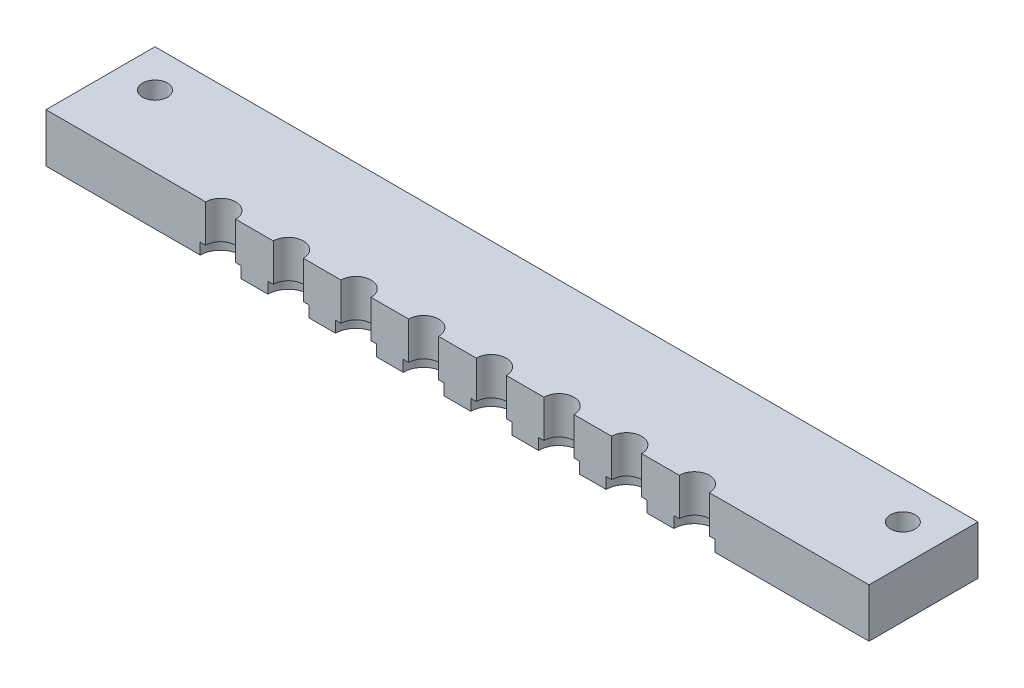
ISO-10303-21;
HEADER;
FILE_DESCRIPTION(('STEP AP214'),'2;1');
FILE_NAME('part.step','',(''),(''),'','','');
FILE_SCHEMA(('AUTOMOTIVE_DESIGN { 1 0 10303 214 1 1 1 1 }'));
ENDSEC;
DATA;
#1=APPLICATION_CONTEXT('core data for automotive mechanical design processes');
#2=APPLICATION_PROTOCOL_DEFINITION('international standard','automotive_design',2000,#1);
#3=PRODUCT_CONTEXT('',#1,'mechanical');
#4=PRODUCT('Part','Part','',(#3));
#5=PRODUCT_RELATED_PRODUCT_CATEGORY('part','',(#4));
#6=PRODUCT_DEFINITION_FORMATION('','',#4);
#7=PRODUCT_DEFINITION_CONTEXT('part definition',#1,'design');
#8=PRODUCT_DEFINITION('design','',#6,#7);
#9=PRODUCT_DEFINITION_SHAPE('','',#8);
#10=(LENGTH_UNIT() NAMED_UNIT(*) SI_UNIT(.MILLI.,.METRE.));
#11=(NAMED_UNIT(*) PLANE_ANGLE_UNIT() SI_UNIT($,.RADIAN.));
#12=(NAMED_UNIT(*) SI_UNIT($,.STERADIAN.) SOLID_ANGLE_UNIT());
#13=UNCERTAINTY_MEASURE_WITH_UNIT(LENGTH_MEASURE(1.E-05),#10,'distance_accuracy_value','');
#14=(GEOMETRIC_REPRESENTATION_CONTEXT(3) GLOBAL_UNCERTAINTY_ASSIGNED_CONTEXT((#13)) GLOBAL_UNIT_ASSIGNED_CONTEXT((#10,
#11,#12)) REPRESENTATION_CONTEXT('',''));
#15=CARTESIAN_POINT('',(0.,0.,0.));
#16=DIRECTION('',(0.,0.,1.));
#17=DIRECTION('',(1.,0.,0.));
#18=AXIS2_PLACEMENT_3D('',#15,#16,#17);
#19=CARTESIAN_POINT('',(0.,0.,0.));
#20=DIRECTION('',(0.,0.,1.));
#21=DIRECTION('',(1.,0.,0.));
#22=AXIS2_PLACEMENT_3D('',#19,#20,#21);
#23=PLANE('',#22);
#24=DIRECTION('',(-1.,0.,0.));
#25=VECTOR('',#24,1.);
#26=CARTESIAN_POINT('',(0.,-22.175,0.));
#27=LINE('',#26,#25);
#28=CARTESIAN_POINT('',(-34.225,-22.175,0.));
#29=VERTEX_POINT('',#28);
#30=CARTESIAN_POINT('',(-54.74,-22.175,0.));
#31=VERTEX_POINT('',#30);
#32=EDGE_CURVE('E391',#29,#31,#27,.T.);
#33=ORIENTED_EDGE('',*,*,#32,.F.);
#34=DIRECTION('',(0.,1.,0.));
#35=VECTOR('',#34,1.);
#36=CARTESIAN_POINT('',(-34.225,22.175,0.));
#37=LINE('',#36,#35);
#38=CARTESIAN_POINT('',(-34.225,-20.675,0.));
#39=VERTEX_POINT('',#38);
#40=EDGE_CURVE('E290',#29,#39,#37,.T.);
#41=ORIENTED_EDGE('',*,*,#40,.T.);
#42=DIRECTION('',(1.,0.,0.));
#43=VECTOR('',#42,1.);
#44=CARTESIAN_POINT('',(-34.225,-20.675,0.));
#45=LINE('',#44,#43);
#46=CARTESIAN_POINT('',(-33.5,-20.675,0.));
#47=VERTEX_POINT('',#46);
#48=EDGE_CURVE('E273',#39,#47,#45,.T.);
#49=ORIENTED_EDGE('',*,*,#48,.T.);
#50=DIRECTION('',(0.,1.,0.));
#51=VECTOR('',#50,1.);
#52=CARTESIAN_POINT('',(-33.5,22.175,0.));
#53=LINE('',#52,#51);
#54=CARTESIAN_POINT('',(-33.5,-15.675,0.));
#55=VERTEX_POINT('',#54);
#56=EDGE_CURVE('E287',#47,#55,#53,.T.);
#57=ORIENTED_EDGE('',*,*,#56,.T.);
#58=DIRECTION('',(1.,0.,0.));
#59=VECTOR('',#58,1.);
#60=CARTESIAN_POINT('',(0.,-15.675,0.));
#61=LINE('',#60,#59);
#62=CARTESIAN_POINT('',(-54.74,-15.675,0.));
#63=VERTEX_POINT('',#62);
#64=EDGE_CURVE('E388',#63,#55,#61,.T.);
#65=ORIENTED_EDGE('',*,*,#64,.F.);
#66=DIRECTION('',(0.,1.,0.));
#67=VECTOR('',#66,1.);
#68=CARTESIAN_POINT('',(-54.74,0.,0.));
#69=LINE('',#68,#67);
#70=EDGE_CURVE('E389',#31,#63,#69,.T.);
#71=ORIENTED_EDGE('',*,*,#70,.F.);
#72=EDGE_LOOP('',(#33,#41,#49,#57,#65,#71));
#73=FACE_BOUND('',#72,.T.);
#74=ADVANCED_FACE('F34',(#73),#23,.T.);
#75=CARTESIAN_POINT('',(-25.225,-22.175,0.));
#76=VERTEX_POINT('',#75);
#77=CARTESIAN_POINT('',(-28.775,-22.175,0.));
#78=VERTEX_POINT('',#77);
#79=EDGE_CURVE('E958',#76,#78,#27,.T.);
#80=ORIENTED_EDGE('',*,*,#79,.F.);
#81=DIRECTION('',(0.,1.,0.));
#82=VECTOR('',#81,1.);
#83=CARTESIAN_POINT('',(-25.225,22.175,0.));
#84=LINE('',#83,#82);
#85=CARTESIAN_POINT('',(-25.225,-20.675,0.));
#86=VERTEX_POINT('',#85);
#87=EDGE_CURVE('E498',#76,#86,#84,.T.);
#88=ORIENTED_EDGE('',*,*,#87,.T.);
#89=DIRECTION('',(1.,0.,0.));
#90=VECTOR('',#89,1.);
#91=CARTESIAN_POINT('',(-25.225,-20.675,0.));
#92=LINE('',#91,#90);
#93=CARTESIAN_POINT('',(-24.5,-20.675,0.));
#94=VERTEX_POINT('',#93);
#95=EDGE_CURVE('E501',#86,#94,#92,.T.);
#96=ORIENTED_EDGE('',*,*,#95,.T.);
#97=DIRECTION('',(0.,1.,0.));
#98=VECTOR('',#97,1.);
#99=CARTESIAN_POINT('',(-24.5,22.175,0.));
#100=LINE('',#99,#98);
#101=CARTESIAN_POINT('',(-24.5,-15.675,0.));
#102=VERTEX_POINT('',#101);
#103=EDGE_CURVE('E508',#94,#102,#100,.T.);
#104=ORIENTED_EDGE('',*,*,#103,.T.);
#105=CARTESIAN_POINT('',(-29.5,-15.675,0.));
#106=VERTEX_POINT('',#105);
#107=EDGE_CURVE('E518',#106,#102,#61,.T.);
#108=ORIENTED_EDGE('',*,*,#107,.F.);
#109=DIRECTION('',(0.,1.,0.));
#110=VECTOR('',#109,1.);
#111=CARTESIAN_POINT('',(-29.5,22.175,0.));
#112=LINE('',#111,#110);
#113=CARTESIAN_POINT('',(-29.5,-20.675,0.));
#114=VERTEX_POINT('',#113);
#115=EDGE_CURVE('E295',#106,#114,#112,.F.);
#116=ORIENTED_EDGE('',*,*,#115,.T.);
#117=CARTESIAN_POINT('',(-28.775,-20.675,0.));
#118=VERTEX_POINT('',#117);
#119=EDGE_CURVE('E275',#114,#118,#45,.T.);
#120=ORIENTED_EDGE('',*,*,#119,.T.);
#121=DIRECTION('',(0.,1.,0.));
#122=VECTOR('',#121,1.);
#123=CARTESIAN_POINT('',(-28.775,22.175,0.));
#124=LINE('',#123,#122);
#125=EDGE_CURVE('E511',#118,#78,#124,.F.);
#126=ORIENTED_EDGE('',*,*,#125,.T.);
#127=EDGE_LOOP('',(#80,#88,#96,#104,#108,#116,#120,#126));
#128=FACE_BOUND('',#127,.T.);
#129=ADVANCED_FACE('F516',(#128),#23,.T.);
#130=CARTESIAN_POINT('',(-16.225,-22.175,0.));
#131=VERTEX_POINT('',#130);
#132=CARTESIAN_POINT('',(-19.775,-22.175,0.));
#133=VERTEX_POINT('',#132);
#134=EDGE_CURVE('E953',#131,#133,#27,.T.);
#135=ORIENTED_EDGE('',*,*,#134,.F.);
#136=DIRECTION('',(0.,1.,0.));
#137=VECTOR('',#136,1.);
#138=CARTESIAN_POINT('',(-16.225,22.175,0.));
#139=LINE('',#138,#137);
#140=CARTESIAN_POINT('',(-16.225,-20.675,0.));
#141=VERTEX_POINT('',#140);
#142=EDGE_CURVE('E482',#131,#141,#139,.T.);
#143=ORIENTED_EDGE('',*,*,#142,.T.);
#144=DIRECTION('',(1.,0.,0.));
#145=VECTOR('',#144,1.);
#146=CARTESIAN_POINT('',(-16.225,-20.675,0.));
#147=LINE('',#146,#145);
#148=CARTESIAN_POINT('',(-15.5,-20.675,0.));
#149=VERTEX_POINT('',#148);
#150=EDGE_CURVE('E485',#141,#149,#147,.T.);
#151=ORIENTED_EDGE('',*,*,#150,.T.);
#152=DIRECTION('',(0.,1.,0.));
#153=VECTOR('',#152,1.);
#154=CARTESIAN_POINT('',(-15.5,22.175,0.));
#155=LINE('',#154,#153);
#156=CARTESIAN_POINT('',(-15.5,-15.675,0.));
#157=VERTEX_POINT('',#156);
#158=EDGE_CURVE('E492',#149,#157,#155,.T.);
#159=ORIENTED_EDGE('',*,*,#158,.T.);
#160=CARTESIAN_POINT('',(-20.5,-15.675,0.));
#161=VERTEX_POINT('',#160);
#162=EDGE_CURVE('E519',#161,#157,#61,.T.);
#163=ORIENTED_EDGE('',*,*,#162,.F.);
#164=DIRECTION('',(0.,1.,0.));
#165=VECTOR('',#164,1.);
#166=CARTESIAN_POINT('',(-20.5,22.175,0.));
#167=LINE('',#166,#165);
#168=CARTESIAN_POINT('',(-20.5,-20.675,0.));
#169=VERTEX_POINT('',#168);
#170=EDGE_CURVE('E505',#161,#169,#167,.F.);
#171=ORIENTED_EDGE('',*,*,#170,.T.);
#172=CARTESIAN_POINT('',(-19.775,-20.675,0.));
#173=VERTEX_POINT('',#172);
#174=EDGE_CURVE('E502',#169,#173,#92,.T.);
#175=ORIENTED_EDGE('',*,*,#174,.T.);
#176=DIRECTION('',(0.,1.,0.));
#177=VECTOR('',#176,1.);
#178=CARTESIAN_POINT('',(-19.775,22.175,0.));
#179=LINE('',#178,#177);
#180=EDGE_CURVE('E495',#173,#133,#179,.F.);
#181=ORIENTED_EDGE('',*,*,#180,.T.);
#182=EDGE_LOOP('',(#135,#143,#151,#159,#163,#171,#175,#181));
#183=FACE_BOUND('',#182,.T.);
#184=ADVANCED_FACE('F926',(#183),#23,.T.);
#185=CARTESIAN_POINT('',(-7.225,-22.175,0.));
#186=VERTEX_POINT('',#185);
#187=CARTESIAN_POINT('',(-10.775,-22.175,0.));
#188=VERTEX_POINT('',#187);
#189=EDGE_CURVE('E959',#186,#188,#27,.T.);
#190=ORIENTED_EDGE('',*,*,#189,.F.);
#191=DIRECTION('',(0.,1.,0.));
#192=VECTOR('',#191,1.);
#193=CARTESIAN_POINT('',(-7.22500000000002,22.175,0.));
#194=LINE('',#193,#192);
#195=CARTESIAN_POINT('',(-7.225,-20.675,0.));
#196=VERTEX_POINT('',#195);
#197=EDGE_CURVE('E466',#186,#196,#194,.T.);
#198=ORIENTED_EDGE('',*,*,#197,.T.);
#199=DIRECTION('',(1.,0.,0.));
#200=VECTOR('',#199,1.);
#201=CARTESIAN_POINT('',(-7.225,-20.675,0.));
#202=LINE('',#201,#200);
#203=CARTESIAN_POINT('',(-6.50000000000001,-20.675,0.));
#204=VERTEX_POINT('',#203);
#205=EDGE_CURVE('E469',#196,#204,#202,.T.);
#206=ORIENTED_EDGE('',*,*,#205,.T.);
#207=DIRECTION('',(0.,1.,0.));
#208=VECTOR('',#207,1.);
#209=CARTESIAN_POINT('',(-6.50000000000002,22.175,0.));
#210=LINE('',#209,#208);
#211=CARTESIAN_POINT('',(-6.5,-15.675,0.));
#212=VERTEX_POINT('',#211);
#213=EDGE_CURVE('E476',#204,#212,#210,.T.);
#214=ORIENTED_EDGE('',*,*,#213,.T.);
#215=CARTESIAN_POINT('',(-11.5,-15.675,0.));
#216=VERTEX_POINT('',#215);
#217=EDGE_CURVE('E520',#216,#212,#61,.T.);
#218=ORIENTED_EDGE('',*,*,#217,.F.);
#219=DIRECTION('',(0.,1.,0.));
#220=VECTOR('',#219,1.);
#221=CARTESIAN_POINT('',(-11.5,22.175,0.));
#222=LINE('',#221,#220);
#223=CARTESIAN_POINT('',(-11.5,-20.675,0.));
#224=VERTEX_POINT('',#223);
#225=EDGE_CURVE('E489',#216,#224,#222,.F.);
#226=ORIENTED_EDGE('',*,*,#225,.T.);
#227=CARTESIAN_POINT('',(-10.775,-20.675,0.));
#228=VERTEX_POINT('',#227);
#229=EDGE_CURVE('E486',#224,#228,#147,.T.);
#230=ORIENTED_EDGE('',*,*,#229,.T.);
#231=DIRECTION('',(0.,1.,0.));
#232=VECTOR('',#231,1.);
#233=CARTESIAN_POINT('',(-10.775,22.175,0.));
#234=LINE('',#233,#232);
#235=EDGE_CURVE('E479',#228,#188,#234,.F.);
#236=ORIENTED_EDGE('',*,*,#235,.T.);
#237=EDGE_LOOP('',(#190,#198,#206,#214,#218,#226,#230,#236));
#238=FACE_BOUND('',#237,.T.);
#239=ADVANCED_FACE('F917',(#238),#23,.T.);
#240=CARTESIAN_POINT('',(1.775,-22.175,0.));
#241=VERTEX_POINT('',#240);
#242=CARTESIAN_POINT('',(-1.77499999999999,-22.175,0.));
#243=VERTEX_POINT('',#242);
#244=EDGE_CURVE('E1000',#241,#243,#27,.T.);
#245=ORIENTED_EDGE('',*,*,#244,.F.);
#246=DIRECTION('',(0.,1.,0.));
#247=VECTOR('',#246,1.);
#248=CARTESIAN_POINT('',(1.77499999999998,22.175,0.));
#249=LINE('',#248,#247);
#250=CARTESIAN_POINT('',(1.775,-20.675,0.));
#251=VERTEX_POINT('',#250);
#252=EDGE_CURVE('E450',#241,#251,#249,.T.);
#253=ORIENTED_EDGE('',*,*,#252,.T.);
#254=DIRECTION('',(1.,0.,0.));
#255=VECTOR('',#254,1.);
#256=CARTESIAN_POINT('',(1.775,-20.675,0.));
#257=LINE('',#256,#255);
#258=CARTESIAN_POINT('',(2.49999999999999,-20.675,0.));
#259=VERTEX_POINT('',#258);
#260=EDGE_CURVE('E453',#251,#259,#257,.T.);
#261=ORIENTED_EDGE('',*,*,#260,.T.);
#262=DIRECTION('',(0.,1.,0.));
#263=VECTOR('',#262,1.);
#264=CARTESIAN_POINT('',(2.49999999999998,22.175,0.));
#265=LINE('',#264,#263);
#266=CARTESIAN_POINT('',(2.5,-15.675,0.));
#267=VERTEX_POINT('',#266);
#268=EDGE_CURVE('E460',#259,#267,#265,.T.);
#269=ORIENTED_EDGE('',*,*,#268,.T.);
#270=CARTESIAN_POINT('',(-2.5,-15.675,0.));
#271=VERTEX_POINT('',#270);
#272=EDGE_CURVE('E521',#271,#267,#61,.T.);
#273=ORIENTED_EDGE('',*,*,#272,.F.);
#274=DIRECTION('',(0.,1.,0.));
#275=VECTOR('',#274,1.);
#276=CARTESIAN_POINT('',(-2.50000000000002,22.175,0.));
#277=LINE('',#276,#275);
#278=CARTESIAN_POINT('',(-2.49999999999998,-20.675,0.));
#279=VERTEX_POINT('',#278);
#280=EDGE_CURVE('E473',#271,#279,#277,.F.);
#281=ORIENTED_EDGE('',*,*,#280,.T.);
#282=CARTESIAN_POINT('',(-1.77499999999999,-20.675,0.));
#283=VERTEX_POINT('',#282);
#284=EDGE_CURVE('E470',#279,#283,#202,.T.);
#285=ORIENTED_EDGE('',*,*,#284,.T.);
#286=DIRECTION('',(0.,1.,0.));
#287=VECTOR('',#286,1.);
#288=CARTESIAN_POINT('',(-1.77500000000001,22.175,0.));
#289=LINE('',#288,#287);
#290=EDGE_CURVE('E463',#283,#243,#289,.F.);
#291=ORIENTED_EDGE('',*,*,#290,.T.);
#292=EDGE_LOOP('',(#245,#253,#261,#269,#273,#281,#285,#291));
#293=FACE_BOUND('',#292,.T.);
#294=ADVANCED_FACE('F908',(#293),#23,.T.);
#295=CARTESIAN_POINT('',(10.775,-22.175,0.));
#296=VERTEX_POINT('',#295);
#297=CARTESIAN_POINT('',(7.22500000000001,-22.175,0.));
#298=VERTEX_POINT('',#297);
#299=EDGE_CURVE('E998',#296,#298,#27,.T.);
#300=ORIENTED_EDGE('',*,*,#299,.F.);
#301=DIRECTION('',(0.,1.,0.));
#302=VECTOR('',#301,1.);
#303=CARTESIAN_POINT('',(10.775,22.175,0.));
#304=LINE('',#303,#302);
#305=CARTESIAN_POINT('',(10.775,-20.675,0.));
#306=VERTEX_POINT('',#305);
#307=EDGE_CURVE('E434',#296,#306,#304,.T.);
#308=ORIENTED_EDGE('',*,*,#307,.T.);
#309=DIRECTION('',(1.,0.,0.));
#310=VECTOR('',#309,1.);
#311=CARTESIAN_POINT('',(10.775,-20.675,0.));
#312=LINE('',#311,#310);
#313=CARTESIAN_POINT('',(11.5,-20.675,0.));
#314=VERTEX_POINT('',#313);
#315=EDGE_CURVE('E437',#306,#314,#312,.T.);
#316=ORIENTED_EDGE('',*,*,#315,.T.);
#317=DIRECTION('',(0.,1.,0.));
#318=VECTOR('',#317,1.);
#319=CARTESIAN_POINT('',(11.5,22.175,0.));
#320=LINE('',#319,#318);
#321=CARTESIAN_POINT('',(11.5,-15.675,0.));
#322=VERTEX_POINT('',#321);
#323=EDGE_CURVE('E444',#314,#322,#320,.T.);
#324=ORIENTED_EDGE('',*,*,#323,.T.);
#325=CARTESIAN_POINT('',(6.5,-15.675,0.));
#326=VERTEX_POINT('',#325);
#327=EDGE_CURVE('E522',#326,#322,#61,.T.);
#328=ORIENTED_EDGE('',*,*,#327,.F.);
#329=DIRECTION('',(0.,1.,0.));
#330=VECTOR('',#329,1.);
#331=CARTESIAN_POINT('',(6.49999999999998,22.175,0.));
#332=LINE('',#331,#330);
#333=CARTESIAN_POINT('',(6.50000000000002,-20.675,0.));
#334=VERTEX_POINT('',#333);
#335=EDGE_CURVE('E457',#326,#334,#332,.F.);
#336=ORIENTED_EDGE('',*,*,#335,.T.);
#337=CARTESIAN_POINT('',(7.22500000000001,-20.675,0.));
#338=VERTEX_POINT('',#337);
#339=EDGE_CURVE('E454',#334,#338,#257,.T.);
#340=ORIENTED_EDGE('',*,*,#339,.T.);
#341=DIRECTION('',(0.,1.,0.));
#342=VECTOR('',#341,1.);
#343=CARTESIAN_POINT('',(7.22499999999999,22.175,0.));
#344=LINE('',#343,#342);
#345=EDGE_CURVE('E447',#338,#298,#344,.F.);
#346=ORIENTED_EDGE('',*,*,#345,.T.);
#347=EDGE_LOOP('',(#300,#308,#316,#324,#328,#336,#340,#346));
#348=FACE_BOUND('',#347,.T.);
#349=ADVANCED_FACE('F899',(#348),#23,.T.);
#350=CARTESIAN_POINT('',(19.775,-22.175,0.));
#351=VERTEX_POINT('',#350);
#352=CARTESIAN_POINT('',(16.225,-22.175,0.));
#353=VERTEX_POINT('',#352);
#354=EDGE_CURVE('E997',#351,#353,#27,.T.);
#355=ORIENTED_EDGE('',*,*,#354,.F.);
#356=DIRECTION('',(0.,1.,0.));
#357=VECTOR('',#356,1.);
#358=CARTESIAN_POINT('',(19.775,22.175,0.));
#359=LINE('',#358,#357);
#360=CARTESIAN_POINT('',(19.775,-20.675,0.));
#361=VERTEX_POINT('',#360);
#362=EDGE_CURVE('E418',#351,#361,#359,.T.);
#363=ORIENTED_EDGE('',*,*,#362,.T.);
#364=DIRECTION('',(1.,0.,0.));
#365=VECTOR('',#364,1.);
#366=CARTESIAN_POINT('',(19.775,-20.675,0.));
#367=LINE('',#366,#365);
#368=CARTESIAN_POINT('',(20.5,-20.675,0.));
#369=VERTEX_POINT('',#368);
#370=EDGE_CURVE('E421',#361,#369,#367,.T.);
#371=ORIENTED_EDGE('',*,*,#370,.T.);
#372=DIRECTION('',(0.,1.,0.));
#373=VECTOR('',#372,1.);
#374=CARTESIAN_POINT('',(20.5,22.175,0.));
#375=LINE('',#374,#373);
#376=CARTESIAN_POINT('',(20.5,-15.675,0.));
#377=VERTEX_POINT('',#376);
#378=EDGE_CURVE('E428',#369,#377,#375,.T.);
#379=ORIENTED_EDGE('',*,*,#378,.T.);
#380=CARTESIAN_POINT('',(15.5,-15.675,0.));
#381=VERTEX_POINT('',#380);
#382=EDGE_CURVE('E523',#381,#377,#61,.T.);
#383=ORIENTED_EDGE('',*,*,#382,.F.);
#384=DIRECTION('',(0.,1.,0.));
#385=VECTOR('',#384,1.);
#386=CARTESIAN_POINT('',(15.5,22.175,0.));
#387=LINE('',#386,#385);
#388=CARTESIAN_POINT('',(15.5,-20.675,0.));
#389=VERTEX_POINT('',#388);
#390=EDGE_CURVE('E441',#381,#389,#387,.F.);
#391=ORIENTED_EDGE('',*,*,#390,.T.);
#392=CARTESIAN_POINT('',(16.225,-20.675,0.));
#393=VERTEX_POINT('',#392);
#394=EDGE_CURVE('E438',#389,#393,#312,.T.);
#395=ORIENTED_EDGE('',*,*,#394,.T.);
#396=DIRECTION('',(0.,1.,0.));
#397=VECTOR('',#396,1.);
#398=CARTESIAN_POINT('',(16.225,22.175,0.));
#399=LINE('',#398,#397);
#400=EDGE_CURVE('E431',#393,#353,#399,.F.);
#401=ORIENTED_EDGE('',*,*,#400,.T.);
#402=EDGE_LOOP('',(#355,#363,#371,#379,#383,#391,#395,#401));
#403=FACE_BOUND('',#402,.T.);
#404=ADVANCED_FACE('F891',(#403),#23,.T.);
#405=CARTESIAN_POINT('',(28.775,-22.175,0.));
#406=VERTEX_POINT('',#405);
#407=CARTESIAN_POINT('',(25.225,-22.175,0.));
#408=VERTEX_POINT('',#407);
#409=EDGE_CURVE('E395',#406,#408,#27,.T.);
#410=ORIENTED_EDGE('',*,*,#409,.F.);
#411=DIRECTION('',(0.,1.,0.));
#412=VECTOR('',#411,1.);
#413=CARTESIAN_POINT('',(28.775,22.175,0.));
#414=LINE('',#413,#412);
#415=CARTESIAN_POINT('',(28.775,-20.675,0.));
#416=VERTEX_POINT('',#415);
#417=EDGE_CURVE('E402',#406,#416,#414,.T.);
#418=ORIENTED_EDGE('',*,*,#417,.T.);
#419=DIRECTION('',(1.,0.,0.));
#420=VECTOR('',#419,1.);
#421=CARTESIAN_POINT('',(28.775,-20.675,0.));
#422=LINE('',#421,#420);
#423=CARTESIAN_POINT('',(29.5,-20.675,0.));
#424=VERTEX_POINT('',#423);
#425=EDGE_CURVE('E405',#416,#424,#422,.T.);
#426=ORIENTED_EDGE('',*,*,#425,.T.);
#427=DIRECTION('',(0.,1.,0.));
#428=VECTOR('',#427,1.);
#429=CARTESIAN_POINT('',(29.5,22.175,0.));
#430=LINE('',#429,#428);
#431=CARTESIAN_POINT('',(29.5,-15.675,0.));
#432=VERTEX_POINT('',#431);
#433=EDGE_CURVE('E412',#424,#432,#430,.T.);
#434=ORIENTED_EDGE('',*,*,#433,.T.);
#435=CARTESIAN_POINT('',(24.5,-15.675,0.));
#436=VERTEX_POINT('',#435);
#437=EDGE_CURVE('E387',#436,#432,#61,.T.);
#438=ORIENTED_EDGE('',*,*,#437,.F.);
#439=DIRECTION('',(0.,1.,0.));
#440=VECTOR('',#439,1.);
#441=CARTESIAN_POINT('',(24.5,22.175,0.));
#442=LINE('',#441,#440);
#443=CARTESIAN_POINT('',(24.5,-20.675,0.));
#444=VERTEX_POINT('',#443);
#445=EDGE_CURVE('E425',#436,#444,#442,.F.);
#446=ORIENTED_EDGE('',*,*,#445,.T.);
#447=CARTESIAN_POINT('',(25.225,-20.675,0.));
#448=VERTEX_POINT('',#447);
#449=EDGE_CURVE('E422',#444,#448,#367,.T.);
#450=ORIENTED_EDGE('',*,*,#449,.T.);
#451=DIRECTION('',(0.,1.,0.));
#452=VECTOR('',#451,1.);
#453=CARTESIAN_POINT('',(25.225,22.175,0.));
#454=LINE('',#453,#452);
#455=EDGE_CURVE('E415',#448,#408,#454,.F.);
#456=ORIENTED_EDGE('',*,*,#455,.T.);
#457=EDGE_LOOP('',(#410,#418,#426,#434,#438,#446,#450,#456));
#458=FACE_BOUND('',#457,.T.);
#459=ADVANCED_FACE('F531',(#458),#23,.T.);
#460=CARTESIAN_POINT('',(54.74,-22.175,0.));
#461=VERTEX_POINT('',#460);
#462=CARTESIAN_POINT('',(34.225,-22.175,0.));
#463=VERTEX_POINT('',#462);
#464=EDGE_CURVE('E392',#461,#463,#27,.T.);
#465=ORIENTED_EDGE('',*,*,#464,.F.);
#466=DIRECTION('',(0.,1.,0.));
#467=VECTOR('',#466,1.);
#468=CARTESIAN_POINT('',(54.74,0.,0.));
#469=LINE('',#468,#467);
#470=CARTESIAN_POINT('',(54.74,-15.675,0.));
#471=VERTEX_POINT('',#470);
#472=EDGE_CURVE('E396',#461,#471,#469,.T.);
#473=ORIENTED_EDGE('',*,*,#472,.T.);
#474=CARTESIAN_POINT('',(33.5,-15.675,0.));
#475=VERTEX_POINT('',#474);
#476=EDGE_CURVE('E302',#475,#471,#61,.T.);
#477=ORIENTED_EDGE('',*,*,#476,.F.);
#478=DIRECTION('',(0.,1.,0.));
#479=VECTOR('',#478,1.);
#480=CARTESIAN_POINT('',(33.5,22.175,0.));
#481=LINE('',#480,#479);
#482=CARTESIAN_POINT('',(33.5,-20.675,0.));
#483=VERTEX_POINT('',#482);
#484=EDGE_CURVE('E409',#475,#483,#481,.F.);
#485=ORIENTED_EDGE('',*,*,#484,.T.);
#486=CARTESIAN_POINT('',(34.225,-20.675,0.));
#487=VERTEX_POINT('',#486);
#488=EDGE_CURVE('E406',#483,#487,#422,.T.);
#489=ORIENTED_EDGE('',*,*,#488,.T.);
#490=DIRECTION('',(0.,1.,0.));
#491=VECTOR('',#490,1.);
#492=CARTESIAN_POINT('',(34.225,22.175,0.));
#493=LINE('',#492,#491);
#494=EDGE_CURVE('E399',#487,#463,#493,.F.);
#495=ORIENTED_EDGE('',*,*,#494,.T.);
#496=EDGE_LOOP('',(#465,#473,#477,#485,#489,#495));
#497=FACE_BOUND('',#496,.T.);
#498=ADVANCED_FACE('F539',(#497),#23,.T.);
#499=CARTESIAN_POINT('',(31.5,22.175,0.));
#500=DIRECTION('',(0.,1.,0.));
#501=DIRECTION('',(-1.,0.,0.));
#502=AXIS2_PLACEMENT_3D('',#499,#500,#501);
#503=CYLINDRICAL_SURFACE('',#502,2.725);
#504=ORIENTED_EDGE('',*,*,#494,.F.);
#505=CARTESIAN_POINT('',(31.5,-20.675,0.));
#506=DIRECTION('',(0.,1.,0.));
#507=DIRECTION('',(-1.,0.,0.));
#508=AXIS2_PLACEMENT_3D('',#505,#506,#507);
#509=CIRCLE('',#508,2.725);
#510=EDGE_CURVE('E346',#487,#416,#509,.T.);
#511=ORIENTED_EDGE('',*,*,#510,.T.);
#512=ORIENTED_EDGE('',*,*,#417,.F.);
#513=CARTESIAN_POINT('',(31.5,-22.175,0.));
#514=DIRECTION('',(0.,1.,0.));
#515=DIRECTION('',(-1.,0.,0.));
#516=AXIS2_PLACEMENT_3D('',#513,#514,#515);
#517=CIRCLE('',#516,2.725);
#518=EDGE_CURVE('E344',#463,#406,#517,.T.);
#519=ORIENTED_EDGE('',*,*,#518,.F.);
#520=EDGE_LOOP('',(#504,#511,#512,#519));
#521=FACE_BOUND('',#520,.T.);
#522=ADVANCED_FACE('F584',(#521),#503,.F.);
#523=CARTESIAN_POINT('',(28.775,-20.675,0.));
#524=DIRECTION('',(0.,1.,0.));
#525=DIRECTION('',(-1.,0.,0.));
#526=AXIS2_PLACEMENT_3D('',#523,#524,#525);
#527=PLANE('',#526);
#528=ORIENTED_EDGE('',*,*,#425,.F.);
#529=ORIENTED_EDGE('',*,*,#510,.F.);
#530=ORIENTED_EDGE('',*,*,#488,.F.);
#531=CARTESIAN_POINT('',(31.5,-20.675,0.));
#532=DIRECTION('',(0.,1.,0.));
#533=DIRECTION('',(-1.,0.,0.));
#534=AXIS2_PLACEMENT_3D('',#531,#532,#533);
#535=CIRCLE('',#534,2.00000000000001);
#536=EDGE_CURVE('E348',#483,#424,#535,.T.);
#537=ORIENTED_EDGE('',*,*,#536,.T.);
#538=EDGE_LOOP('',(#528,#529,#530,#537));
#539=FACE_BOUND('',#538,.T.);
#540=ADVANCED_FACE('F586',(#539),#527,.F.);
#541=CARTESIAN_POINT('',(22.5,22.175,0.));
#542=DIRECTION('',(0.,1.,0.));
#543=DIRECTION('',(-1.,0.,0.));
#544=AXIS2_PLACEMENT_3D('',#541,#542,#543);
#545=CYLINDRICAL_SURFACE('',#544,2.725);
#546=ORIENTED_EDGE('',*,*,#455,.F.);
#547=CARTESIAN_POINT('',(22.5,-20.675,0.));
#548=DIRECTION('',(0.,1.,0.));
#549=DIRECTION('',(-1.,0.,0.));
#550=AXIS2_PLACEMENT_3D('',#547,#548,#549);
#551=CIRCLE('',#550,2.725);
#552=EDGE_CURVE('E340',#448,#361,#551,.T.);
#553=ORIENTED_EDGE('',*,*,#552,.T.);
#554=ORIENTED_EDGE('',*,*,#362,.F.);
#555=CARTESIAN_POINT('',(22.5,-22.175,0.));
#556=DIRECTION('',(0.,1.,0.));
#557=DIRECTION('',(-1.,0.,0.));
#558=AXIS2_PLACEMENT_3D('',#555,#556,#557);
#559=CIRCLE('',#558,2.725);
#560=EDGE_CURVE('E338',#408,#351,#559,.T.);
#561=ORIENTED_EDGE('',*,*,#560,.F.);
#562=EDGE_LOOP('',(#546,#553,#554,#561));
#563=FACE_BOUND('',#562,.T.);
#564=ADVANCED_FACE('F593',(#563),#545,.F.);
#565=CARTESIAN_POINT('',(19.775,-20.675,0.));
#566=DIRECTION('',(0.,1.,0.));
#567=DIRECTION('',(-1.,0.,0.));
#568=AXIS2_PLACEMENT_3D('',#565,#566,#567);
#569=PLANE('',#568);
#570=ORIENTED_EDGE('',*,*,#370,.F.);
#571=ORIENTED_EDGE('',*,*,#552,.F.);
#572=ORIENTED_EDGE('',*,*,#449,.F.);
#573=CARTESIAN_POINT('',(22.5,-20.675,0.));
#574=DIRECTION('',(0.,1.,0.));
#575=DIRECTION('',(-1.,0.,0.));
#576=AXIS2_PLACEMENT_3D('',#573,#574,#575);
#577=CIRCLE('',#576,2.00000000000001);
#578=EDGE_CURVE('E342',#444,#369,#577,.T.);
#579=ORIENTED_EDGE('',*,*,#578,.T.);
#580=EDGE_LOOP('',(#570,#571,#572,#579));
#581=FACE_BOUND('',#580,.T.);
#582=ADVANCED_FACE('F605',(#581),#569,.F.);
#583=CARTESIAN_POINT('',(13.5,22.175,0.));
#584=DIRECTION('',(0.,1.,0.));
#585=DIRECTION('',(-1.,0.,0.));
#586=AXIS2_PLACEMENT_3D('',#583,#584,#585);
#587=CYLINDRICAL_SURFACE('',#586,2.725);
#588=ORIENTED_EDGE('',*,*,#400,.F.);
#589=CARTESIAN_POINT('',(13.5,-20.675,0.));
#590=DIRECTION('',(0.,1.,0.));
#591=DIRECTION('',(-1.,0.,0.));
#592=AXIS2_PLACEMENT_3D('',#589,#590,#591);
#593=CIRCLE('',#592,2.725);
#594=EDGE_CURVE('E334',#393,#306,#593,.T.);
#595=ORIENTED_EDGE('',*,*,#594,.T.);
#596=ORIENTED_EDGE('',*,*,#307,.F.);
#597=CARTESIAN_POINT('',(13.5,-22.175,0.));
#598=DIRECTION('',(0.,1.,0.));
#599=DIRECTION('',(-1.,0.,0.));
#600=AXIS2_PLACEMENT_3D('',#597,#598,#599);
#601=CIRCLE('',#600,2.725);
#602=EDGE_CURVE('E332',#353,#296,#601,.T.);
#603=ORIENTED_EDGE('',*,*,#602,.F.);
#604=EDGE_LOOP('',(#588,#595,#596,#603));
#605=FACE_BOUND('',#604,.T.);
#606=ADVANCED_FACE('F609',(#605),#587,.F.);
#607=CARTESIAN_POINT('',(10.775,-20.675,0.));
#608=DIRECTION('',(0.,1.,0.));
#609=DIRECTION('',(-1.,0.,0.));
#610=AXIS2_PLACEMENT_3D('',#607,#608,#609);
#611=PLANE('',#610);
#612=ORIENTED_EDGE('',*,*,#315,.F.);
#613=ORIENTED_EDGE('',*,*,#594,.F.);
#614=ORIENTED_EDGE('',*,*,#394,.F.);
#615=CARTESIAN_POINT('',(13.5,-20.675,0.));
#616=DIRECTION('',(0.,1.,0.));
#617=DIRECTION('',(-1.,0.,0.));
#618=AXIS2_PLACEMENT_3D('',#615,#616,#617);
#619=CIRCLE('',#618,2.00000000000001);
#620=EDGE_CURVE('E336',#389,#314,#619,.T.);
#621=ORIENTED_EDGE('',*,*,#620,.T.);
#622=EDGE_LOOP('',(#612,#613,#614,#621));
#623=FACE_BOUND('',#622,.T.);
#624=ADVANCED_FACE('F617',(#623),#611,.F.);
#625=CARTESIAN_POINT('',(4.49999999999998,22.175,0.));
#626=DIRECTION('',(0.,1.,0.));
#627=DIRECTION('',(-1.,0.,0.));
#628=AXIS2_PLACEMENT_3D('',#625,#626,#627);
#629=CYLINDRICAL_SURFACE('',#628,2.725);
#630=ORIENTED_EDGE('',*,*,#345,.F.);
#631=CARTESIAN_POINT('',(4.5,-20.675,0.));
#632=DIRECTION('',(0.,1.,0.));
#633=DIRECTION('',(-1.,0.,0.));
#634=AXIS2_PLACEMENT_3D('',#631,#632,#633);
#635=CIRCLE('',#634,2.725);
#636=EDGE_CURVE('E328',#338,#251,#635,.T.);
#637=ORIENTED_EDGE('',*,*,#636,.T.);
#638=ORIENTED_EDGE('',*,*,#252,.F.);
#639=CARTESIAN_POINT('',(4.5,-22.175,0.));
#640=DIRECTION('',(0.,1.,0.));
#641=DIRECTION('',(-1.,0.,0.));
#642=AXIS2_PLACEMENT_3D('',#639,#640,#641);
#643=CIRCLE('',#642,2.725);
#644=EDGE_CURVE('E326',#298,#241,#643,.T.);
#645=ORIENTED_EDGE('',*,*,#644,.F.);
#646=EDGE_LOOP('',(#630,#637,#638,#645));
#647=FACE_BOUND('',#646,.T.);
#648=ADVANCED_FACE('F621',(#647),#629,.F.);
#649=CARTESIAN_POINT('',(1.775,-20.675,0.));
#650=DIRECTION('',(0.,1.,0.));
#651=DIRECTION('',(-1.,0.,0.));
#652=AXIS2_PLACEMENT_3D('',#649,#650,#651);
#653=PLANE('',#652);
#654=ORIENTED_EDGE('',*,*,#260,.F.);
#655=ORIENTED_EDGE('',*,*,#636,.F.);
#656=ORIENTED_EDGE('',*,*,#339,.F.);
#657=CARTESIAN_POINT('',(4.5,-20.675,0.));
#658=DIRECTION('',(0.,1.,0.));
#659=DIRECTION('',(-1.,0.,0.));
#660=AXIS2_PLACEMENT_3D('',#657,#658,#659);
#661=CIRCLE('',#660,2.00000000000001);
#662=EDGE_CURVE('E330',#334,#259,#661,.T.);
#663=ORIENTED_EDGE('',*,*,#662,.T.);
#664=EDGE_LOOP('',(#654,#655,#656,#663));
#665=FACE_BOUND('',#664,.T.);
#666=ADVANCED_FACE('F629',(#665),#653,.F.);
#667=CARTESIAN_POINT('',(-4.50000000000002,22.175,0.));
#668=DIRECTION('',(0.,1.,0.));
#669=DIRECTION('',(-1.,0.,0.));
#670=AXIS2_PLACEMENT_3D('',#667,#668,#669);
#671=CYLINDRICAL_SURFACE('',#670,2.725);
#672=ORIENTED_EDGE('',*,*,#290,.F.);
#673=CARTESIAN_POINT('',(-4.5,-20.675,0.));
#674=DIRECTION('',(0.,1.,0.));
#675=DIRECTION('',(-1.,0.,0.));
#676=AXIS2_PLACEMENT_3D('',#673,#674,#675);
#677=CIRCLE('',#676,2.725);
#678=EDGE_CURVE('E322',#283,#196,#677,.T.);
#679=ORIENTED_EDGE('',*,*,#678,.T.);
#680=ORIENTED_EDGE('',*,*,#197,.F.);
#681=CARTESIAN_POINT('',(-4.5,-22.175,0.));
#682=DIRECTION('',(0.,1.,0.));
#683=DIRECTION('',(-1.,0.,0.));
#684=AXIS2_PLACEMENT_3D('',#681,#682,#683);
#685=CIRCLE('',#684,2.725);
#686=EDGE_CURVE('E320',#243,#186,#685,.T.);
#687=ORIENTED_EDGE('',*,*,#686,.F.);
#688=EDGE_LOOP('',(#672,#679,#680,#687));
#689=FACE_BOUND('',#688,.T.);
#690=ADVANCED_FACE('F633',(#689),#671,.F.);
#691=CARTESIAN_POINT('',(-7.225,-20.675,0.));
#692=DIRECTION('',(0.,1.,0.));
#693=DIRECTION('',(-1.,0.,0.));
#694=AXIS2_PLACEMENT_3D('',#691,#692,#693);
#695=PLANE('',#694);
#696=ORIENTED_EDGE('',*,*,#205,.F.);
#697=ORIENTED_EDGE('',*,*,#678,.F.);
#698=ORIENTED_EDGE('',*,*,#284,.F.);
#699=CARTESIAN_POINT('',(-4.5,-20.675,0.));
#700=DIRECTION('',(0.,1.,0.));
#701=DIRECTION('',(-1.,0.,0.));
#702=AXIS2_PLACEMENT_3D('',#699,#700,#701);
#703=CIRCLE('',#702,2.00000000000001);
#704=EDGE_CURVE('E324',#279,#204,#703,.T.);
#705=ORIENTED_EDGE('',*,*,#704,.T.);
#706=EDGE_LOOP('',(#696,#697,#698,#705));
#707=FACE_BOUND('',#706,.T.);
#708=ADVANCED_FACE('F641',(#707),#695,.F.);
#709=CARTESIAN_POINT('',(-13.5,22.175,0.));
#710=DIRECTION('',(0.,1.,0.));
#711=DIRECTION('',(-1.,0.,0.));
#712=AXIS2_PLACEMENT_3D('',#709,#710,#711);
#713=CYLINDRICAL_SURFACE('',#712,2.725);
#714=ORIENTED_EDGE('',*,*,#235,.F.);
#715=CARTESIAN_POINT('',(-13.5,-20.675,0.));
#716=DIRECTION('',(0.,1.,0.));
#717=DIRECTION('',(-1.,0.,0.));
#718=AXIS2_PLACEMENT_3D('',#715,#716,#717);
#719=CIRCLE('',#718,2.725);
#720=EDGE_CURVE('E316',#228,#141,#719,.T.);
#721=ORIENTED_EDGE('',*,*,#720,.T.);
#722=ORIENTED_EDGE('',*,*,#142,.F.);
#723=CARTESIAN_POINT('',(-13.5,-22.175,0.));
#724=DIRECTION('',(0.,1.,0.));
#725=DIRECTION('',(-1.,0.,0.));
#726=AXIS2_PLACEMENT_3D('',#723,#724,#725);
#727=CIRCLE('',#726,2.725);
#728=EDGE_CURVE('E314',#188,#131,#727,.T.);
#729=ORIENTED_EDGE('',*,*,#728,.F.);
#730=EDGE_LOOP('',(#714,#721,#722,#729));
#731=FACE_BOUND('',#730,.T.);
#732=ADVANCED_FACE('F645',(#731),#713,.F.);
#733=CARTESIAN_POINT('',(-16.225,-20.675,0.));
#734=DIRECTION('',(0.,1.,0.));
#735=DIRECTION('',(-1.,0.,0.));
#736=AXIS2_PLACEMENT_3D('',#733,#734,#735);
#737=PLANE('',#736);
#738=ORIENTED_EDGE('',*,*,#150,.F.);
#739=ORIENTED_EDGE('',*,*,#720,.F.);
#740=ORIENTED_EDGE('',*,*,#229,.F.);
#741=CARTESIAN_POINT('',(-13.5,-20.675,0.));
#742=DIRECTION('',(0.,1.,0.));
#743=DIRECTION('',(-1.,0.,0.));
#744=AXIS2_PLACEMENT_3D('',#741,#742,#743);
#745=CIRCLE('',#744,2.00000000000001);
#746=EDGE_CURVE('E318',#224,#149,#745,.T.);
#747=ORIENTED_EDGE('',*,*,#746,.T.);
#748=EDGE_LOOP('',(#738,#739,#740,#747));
#749=FACE_BOUND('',#748,.T.);
#750=ADVANCED_FACE('F653',(#749),#737,.F.);
#751=CARTESIAN_POINT('',(-22.5,22.175,0.));
#752=DIRECTION('',(0.,1.,0.));
#753=DIRECTION('',(-1.,0.,0.));
#754=AXIS2_PLACEMENT_3D('',#751,#752,#753);
#755=CYLINDRICAL_SURFACE('',#754,2.725);
#756=ORIENTED_EDGE('',*,*,#180,.F.);
#757=CARTESIAN_POINT('',(-22.5,-20.675,0.));
#758=DIRECTION('',(0.,1.,0.));
#759=DIRECTION('',(-1.,0.,0.));
#760=AXIS2_PLACEMENT_3D('',#757,#758,#759);
#761=CIRCLE('',#760,2.725);
#762=EDGE_CURVE('E310',#173,#86,#761,.T.);
#763=ORIENTED_EDGE('',*,*,#762,.T.);
#764=ORIENTED_EDGE('',*,*,#87,.F.);
#765=CARTESIAN_POINT('',(-22.5,-22.175,0.));
#766=DIRECTION('',(0.,1.,0.));
#767=DIRECTION('',(-1.,0.,0.));
#768=AXIS2_PLACEMENT_3D('',#765,#766,#767);
#769=CIRCLE('',#768,2.725);
#770=EDGE_CURVE('E280',#133,#76,#769,.T.);
#771=ORIENTED_EDGE('',*,*,#770,.F.);
#772=EDGE_LOOP('',(#756,#763,#764,#771));
#773=FACE_BOUND('',#772,.T.);
#774=ADVANCED_FACE('F657',(#773),#755,.F.);
#775=CARTESIAN_POINT('',(-25.225,-20.675,0.));
#776=DIRECTION('',(0.,1.,0.));
#777=DIRECTION('',(-1.,0.,0.));
#778=AXIS2_PLACEMENT_3D('',#775,#776,#777);
#779=PLANE('',#778);
#780=ORIENTED_EDGE('',*,*,#95,.F.);
#781=ORIENTED_EDGE('',*,*,#762,.F.);
#782=ORIENTED_EDGE('',*,*,#174,.F.);
#783=CARTESIAN_POINT('',(-22.5,-20.675,0.));
#784=DIRECTION('',(0.,1.,0.));
#785=DIRECTION('',(-1.,0.,0.));
#786=AXIS2_PLACEMENT_3D('',#783,#784,#785);
#787=CIRCLE('',#786,2.00000000000001);
#788=EDGE_CURVE('E312',#169,#94,#787,.T.);
#789=ORIENTED_EDGE('',*,*,#788,.T.);
#790=EDGE_LOOP('',(#780,#781,#782,#789));
#791=FACE_BOUND('',#790,.T.);
#792=ADVANCED_FACE('F569',(#791),#779,.F.);
#793=CARTESIAN_POINT('',(0.,-22.175,14.5));
#794=DIRECTION('',(0.,-1.,0.));
#795=DIRECTION('',(1.,0.,0.));
#796=AXIS2_PLACEMENT_3D('',#793,#794,#795);
#797=PLANE('',#796);
#798=CARTESIAN_POINT('',(49.74,-22.175,-9.5));
#799=DIRECTION('',(0.,1.,0.));
#800=DIRECTION('',(1.,0.,0.));
#801=AXIS2_PLACEMENT_3D('',#798,#799,#800);
#802=CIRCLE('',#801,1.65);
#803=CARTESIAN_POINT('',(51.39,-22.175,-9.5));
#804=VERTEX_POINT('',#803);
#805=EDGE_CURVE('E11',#804,#804,#802,.T.);
#806=ORIENTED_EDGE('',*,*,#805,.T.);
#807=EDGE_LOOP('',(#806));
#808=FACE_BOUND('',#807,.T.);
#809=CARTESIAN_POINT('',(-49.74,-22.175,-9.5));
#810=DIRECTION('',(0.,1.,0.));
#811=DIRECTION('',(-1.,0.,0.));
#812=AXIS2_PLACEMENT_3D('',#809,#810,#811);
#813=CIRCLE('',#812,1.65);
#814=CARTESIAN_POINT('',(-51.39,-22.175,-9.5));
#815=VERTEX_POINT('',#814);
#816=EDGE_CURVE('E43',#815,#815,#813,.T.);
#817=ORIENTED_EDGE('',*,*,#816,.T.);
#818=EDGE_LOOP('',(#817));
#819=FACE_BOUND('',#818,.T.);
#820=DIRECTION('',(0.,0.,-1.));
#821=VECTOR('',#820,1.);
#822=CARTESIAN_POINT('',(54.74,-22.175,14.5));
#823=LINE('',#822,#821);
#824=CARTESIAN_POINT('',(54.74,-22.175,-14.5));
#825=VERTEX_POINT('',#824);
#826=EDGE_CURVE('E301',#461,#825,#823,.T.);
#827=ORIENTED_EDGE('',*,*,#826,.F.);
#828=ORIENTED_EDGE('',*,*,#464,.T.);
#829=ORIENTED_EDGE('',*,*,#518,.T.);
#830=ORIENTED_EDGE('',*,*,#409,.T.);
#831=ORIENTED_EDGE('',*,*,#560,.T.);
#832=ORIENTED_EDGE('',*,*,#354,.T.);
#833=ORIENTED_EDGE('',*,*,#602,.T.);
#834=ORIENTED_EDGE('',*,*,#299,.T.);
#835=ORIENTED_EDGE('',*,*,#644,.T.);
#836=ORIENTED_EDGE('',*,*,#244,.T.);
#837=ORIENTED_EDGE('',*,*,#686,.T.);
#838=ORIENTED_EDGE('',*,*,#189,.T.);
#839=ORIENTED_EDGE('',*,*,#728,.T.);
#840=ORIENTED_EDGE('',*,*,#134,.T.);
#841=ORIENTED_EDGE('',*,*,#770,.T.);
#842=ORIENTED_EDGE('',*,*,#79,.T.);
#843=CARTESIAN_POINT('',(-31.5,-22.175,0.));
#844=DIRECTION('',(0.,1.,0.));
#845=DIRECTION('',(-1.,0.,0.));
#846=AXIS2_PLACEMENT_3D('',#843,#844,#845);
#847=CIRCLE('',#846,2.725);
#848=EDGE_CURVE('E305',#78,#29,#847,.T.);
#849=ORIENTED_EDGE('',*,*,#848,.T.);
#850=ORIENTED_EDGE('',*,*,#32,.T.);
#851=DIRECTION('',(0.,0.,-1.));
#852=VECTOR('',#851,1.);
#853=CARTESIAN_POINT('',(-54.74,-22.175,14.5));
#854=LINE('',#853,#852);
#855=CARTESIAN_POINT('',(-54.74,-22.175,-14.5));
#856=VERTEX_POINT('',#855);
#857=EDGE_CURVE('E299',#31,#856,#854,.T.);
#858=ORIENTED_EDGE('',*,*,#857,.T.);
#859=DIRECTION('',(-1.,0.,0.));
#860=VECTOR('',#859,1.);
#861=CARTESIAN_POINT('',(0.,-22.175,-14.5));
#862=LINE('',#861,#860);
#863=EDGE_CURVE('E304',#825,#856,#862,.T.);
#864=ORIENTED_EDGE('',*,*,#863,.F.);
#865=EDGE_LOOP('',(#827,#828,#829,#830,#831,#832,#833,#834,#835,#836,#837,#838,#839,#840,#841,
#842,#849,#850,#858,#864));
#866=FACE_BOUND('',#865,.T.);
#867=ADVANCED_FACE('F565',(#808,#819,#866),#797,.T.);
#868=CARTESIAN_POINT('',(-31.5,22.175,0.));
#869=DIRECTION('',(0.,1.,0.));
#870=DIRECTION('',(-1.,0.,0.));
#871=AXIS2_PLACEMENT_3D('',#868,#869,#870);
#872=CYLINDRICAL_SURFACE('',#871,2.725);
#873=ORIENTED_EDGE('',*,*,#125,.F.);
#874=CARTESIAN_POINT('',(-31.5,-20.675,0.));
#875=DIRECTION('',(0.,1.,0.));
#876=DIRECTION('',(-1.,0.,0.));
#877=AXIS2_PLACEMENT_3D('',#874,#875,#876);
#878=CIRCLE('',#877,2.725);
#879=EDGE_CURVE('E281',#118,#39,#878,.T.);
#880=ORIENTED_EDGE('',*,*,#879,.T.);
#881=ORIENTED_EDGE('',*,*,#40,.F.);
#882=ORIENTED_EDGE('',*,*,#848,.F.);
#883=EDGE_LOOP('',(#873,#880,#881,#882));
#884=FACE_BOUND('',#883,.T.);
#885=ADVANCED_FACE('F568',(#884),#872,.F.);
#886=CARTESIAN_POINT('',(-34.225,-20.675,0.));
#887=DIRECTION('',(0.,1.,0.));
#888=DIRECTION('',(-1.,0.,0.));
#889=AXIS2_PLACEMENT_3D('',#886,#887,#888);
#890=PLANE('',#889);
#891=ORIENTED_EDGE('',*,*,#48,.F.);
#892=ORIENTED_EDGE('',*,*,#879,.F.);
#893=ORIENTED_EDGE('',*,*,#119,.F.);
#894=CARTESIAN_POINT('',(-31.5,-20.675,0.));
#895=DIRECTION('',(0.,1.,0.));
#896=DIRECTION('',(-1.,0.,0.));
#897=AXIS2_PLACEMENT_3D('',#894,#895,#896);
#898=CIRCLE('',#897,2.00000000000001);
#899=EDGE_CURVE('E270',#114,#47,#898,.T.);
#900=ORIENTED_EDGE('',*,*,#899,.T.);
#901=EDGE_LOOP('',(#891,#892,#893,#900));
#902=FACE_BOUND('',#901,.T.);
#903=ADVANCED_FACE('F272',(#902),#890,.F.);
#904=CARTESIAN_POINT('',(0.,0.,-14.5));
#905=DIRECTION('',(0.,0.,1.));
#906=DIRECTION('',(1.,0.,0.));
#907=AXIS2_PLACEMENT_3D('',#904,#905,#906);
#908=PLANE('',#907);
#909=DIRECTION('',(1.,0.,0.));
#910=VECTOR('',#909,1.);
#911=CARTESIAN_POINT('',(0.,-15.675,-14.5));
#912=LINE('',#911,#910);
#913=CARTESIAN_POINT('',(-54.74,-15.675,-14.5));
#914=VERTEX_POINT('',#913);
#915=CARTESIAN_POINT('',(54.74,-15.675,-14.5));
#916=VERTEX_POINT('',#915);
#917=EDGE_CURVE('E371',#914,#916,#912,.T.);
#918=ORIENTED_EDGE('',*,*,#917,.T.);
#919=DIRECTION('',(0.,1.,0.));
#920=VECTOR('',#919,1.);
#921=CARTESIAN_POINT('',(54.74,0.,-14.5));
#922=LINE('',#921,#920);
#923=EDGE_CURVE('E307',#825,#916,#922,.T.);
#924=ORIENTED_EDGE('',*,*,#923,.F.);
#925=ORIENTED_EDGE('',*,*,#863,.T.);
#926=DIRECTION('',(0.,1.,0.));
#927=VECTOR('',#926,1.);
#928=CARTESIAN_POINT('',(-54.74,0.,-14.5));
#929=LINE('',#928,#927);
#930=EDGE_CURVE('E545',#856,#914,#929,.T.);
#931=ORIENTED_EDGE('',*,*,#930,.T.);
#932=EDGE_LOOP('',(#918,#924,#925,#931));
#933=FACE_BOUND('',#932,.T.);
#934=ADVANCED_FACE('F574',(#933),#908,.F.);
#935=CARTESIAN_POINT('',(54.74,0.,14.5));
#936=DIRECTION('',(-1.,0.,0.));
#937=DIRECTION('',(0.,0.,1.));
#938=AXIS2_PLACEMENT_3D('',#935,#936,#937);
#939=PLANE('',#938);
#940=ORIENTED_EDGE('',*,*,#472,.F.);
#941=ORIENTED_EDGE('',*,*,#826,.T.);
#942=ORIENTED_EDGE('',*,*,#923,.T.);
#943=DIRECTION('',(0.,0.,-1.));
#944=VECTOR('',#943,1.);
#945=CARTESIAN_POINT('',(54.74,-15.675,14.5));
#946=LINE('',#945,#944);
#947=EDGE_CURVE('E38',#471,#916,#946,.T.);
#948=ORIENTED_EDGE('',*,*,#947,.F.);
#949=EDGE_LOOP('',(#940,#941,#942,#948));
#950=FACE_BOUND('',#949,.T.);
#951=ADVANCED_FACE('F542',(#950),#939,.F.);
#952=CARTESIAN_POINT('',(31.5,22.175,0.));
#953=DIRECTION('',(0.,1.,0.));
#954=DIRECTION('',(-1.,0.,0.));
#955=AXIS2_PLACEMENT_3D('',#952,#953,#954);
#956=CYLINDRICAL_SURFACE('',#955,2.);
#957=ORIENTED_EDGE('',*,*,#484,.F.);
#958=CARTESIAN_POINT('',(31.5,-15.675,0.));
#959=DIRECTION('',(0.,1.,0.));
#960=DIRECTION('',(0.,0.,1.));
#961=AXIS2_PLACEMENT_3D('',#958,#959,#960);
#962=CIRCLE('',#961,2.);
#963=EDGE_CURVE('E369',#432,#475,#962,.F.);
#964=ORIENTED_EDGE('',*,*,#963,.F.);
#965=ORIENTED_EDGE('',*,*,#433,.F.);
#966=ORIENTED_EDGE('',*,*,#536,.F.);
#967=EDGE_LOOP('',(#957,#964,#965,#966));
#968=FACE_BOUND('',#967,.T.);
#969=ADVANCED_FACE('F535',(#968),#956,.F.);
#970=CARTESIAN_POINT('',(22.5,22.175,0.));
#971=DIRECTION('',(0.,1.,0.));
#972=DIRECTION('',(-1.,0.,0.));
#973=AXIS2_PLACEMENT_3D('',#970,#971,#972);
#974=CYLINDRICAL_SURFACE('',#973,2.);
#975=ORIENTED_EDGE('',*,*,#445,.F.);
#976=CARTESIAN_POINT('',(22.5,-15.675,0.));
#977=DIRECTION('',(0.,1.,0.));
#978=DIRECTION('',(0.,0.,1.));
#979=AXIS2_PLACEMENT_3D('',#976,#977,#978);
#980=CIRCLE('',#979,2.);
#981=EDGE_CURVE('E366',#377,#436,#980,.F.);
#982=ORIENTED_EDGE('',*,*,#981,.F.);
#983=ORIENTED_EDGE('',*,*,#378,.F.);
#984=ORIENTED_EDGE('',*,*,#578,.F.);
#985=EDGE_LOOP('',(#975,#982,#983,#984));
#986=FACE_BOUND('',#985,.T.);
#987=ADVANCED_FACE('F602',(#986),#974,.F.);
#988=CARTESIAN_POINT('',(13.5,22.175,0.));
#989=DIRECTION('',(0.,1.,0.));
#990=DIRECTION('',(-1.,0.,0.));
#991=AXIS2_PLACEMENT_3D('',#988,#989,#990);
#992=CYLINDRICAL_SURFACE('',#991,2.);
#993=ORIENTED_EDGE('',*,*,#390,.F.);
#994=CARTESIAN_POINT('',(13.5,-15.675,0.));
#995=DIRECTION('',(0.,1.,0.));
#996=DIRECTION('',(0.,0.,1.));
#997=AXIS2_PLACEMENT_3D('',#994,#995,#996);
#998=CIRCLE('',#997,2.);
#999=EDGE_CURVE('E363',#322,#381,#998,.F.);
#1000=ORIENTED_EDGE('',*,*,#999,.F.);
#1001=ORIENTED_EDGE('',*,*,#323,.F.);
#1002=ORIENTED_EDGE('',*,*,#620,.F.);
#1003=EDGE_LOOP('',(#993,#1000,#1001,#1002));
#1004=FACE_BOUND('',#1003,.T.);
#1005=ADVANCED_FACE('F613',(#1004),#992,.F.);
#1006=CARTESIAN_POINT('',(4.49999999999998,22.175,0.));
#1007=DIRECTION('',(0.,1.,0.));
#1008=DIRECTION('',(-1.,0.,0.));
#1009=AXIS2_PLACEMENT_3D('',#1006,#1007,#1008);
#1010=CYLINDRICAL_SURFACE('',#1009,2.);
#1011=ORIENTED_EDGE('',*,*,#335,.F.);
#1012=CARTESIAN_POINT('',(4.5,-15.675,0.));
#1013=DIRECTION('',(0.,1.,0.));
#1014=DIRECTION('',(0.,0.,1.));
#1015=AXIS2_PLACEMENT_3D('',#1012,#1013,#1014);
#1016=CIRCLE('',#1015,2.);
#1017=EDGE_CURVE('E360',#267,#326,#1016,.F.);
#1018=ORIENTED_EDGE('',*,*,#1017,.F.);
#1019=ORIENTED_EDGE('',*,*,#268,.F.);
#1020=ORIENTED_EDGE('',*,*,#662,.F.);
#1021=EDGE_LOOP('',(#1011,#1018,#1019,#1020));
#1022=FACE_BOUND('',#1021,.T.);
#1023=ADVANCED_FACE('F625',(#1022),#1010,.F.);
#1024=CARTESIAN_POINT('',(-4.50000000000002,22.175,0.));
#1025=DIRECTION('',(0.,1.,0.));
#1026=DIRECTION('',(-1.,0.,0.));
#1027=AXIS2_PLACEMENT_3D('',#1024,#1025,#1026);
#1028=CYLINDRICAL_SURFACE('',#1027,2.);
#1029=ORIENTED_EDGE('',*,*,#280,.F.);
#1030=CARTESIAN_POINT('',(-4.5,-15.675,0.));
#1031=DIRECTION('',(0.,1.,0.));
#1032=DIRECTION('',(0.,0.,1.));
#1033=AXIS2_PLACEMENT_3D('',#1030,#1031,#1032);
#1034=CIRCLE('',#1033,2.);
#1035=EDGE_CURVE('E357',#212,#271,#1034,.F.);
#1036=ORIENTED_EDGE('',*,*,#1035,.F.);
#1037=ORIENTED_EDGE('',*,*,#213,.F.);
#1038=ORIENTED_EDGE('',*,*,#704,.F.);
#1039=EDGE_LOOP('',(#1029,#1036,#1037,#1038));
#1040=FACE_BOUND('',#1039,.T.);
#1041=ADVANCED_FACE('F637',(#1040),#1028,.F.);
#1042=CARTESIAN_POINT('',(-13.5,22.175,0.));
#1043=DIRECTION('',(0.,1.,0.));
#1044=DIRECTION('',(-1.,0.,0.));
#1045=AXIS2_PLACEMENT_3D('',#1042,#1043,#1044);
#1046=CYLINDRICAL_SURFACE('',#1045,2.);
#1047=ORIENTED_EDGE('',*,*,#225,.F.);
#1048=CARTESIAN_POINT('',(-13.5,-15.675,0.));
#1049=DIRECTION('',(0.,1.,0.));
#1050=DIRECTION('',(0.,0.,1.));
#1051=AXIS2_PLACEMENT_3D('',#1048,#1049,#1050);
#1052=CIRCLE('',#1051,2.);
#1053=EDGE_CURVE('E354',#157,#216,#1052,.F.);
#1054=ORIENTED_EDGE('',*,*,#1053,.F.);
#1055=ORIENTED_EDGE('',*,*,#158,.F.);
#1056=ORIENTED_EDGE('',*,*,#746,.F.);
#1057=EDGE_LOOP('',(#1047,#1054,#1055,#1056));
#1058=FACE_BOUND('',#1057,.T.);
#1059=ADVANCED_FACE('F649',(#1058),#1046,.F.);
#1060=CARTESIAN_POINT('',(-22.5,22.175,0.));
#1061=DIRECTION('',(0.,1.,0.));
#1062=DIRECTION('',(-1.,0.,0.));
#1063=AXIS2_PLACEMENT_3D('',#1060,#1061,#1062);
#1064=CYLINDRICAL_SURFACE('',#1063,2.);
#1065=ORIENTED_EDGE('',*,*,#170,.F.);
#1066=CARTESIAN_POINT('',(-22.5,-15.675,0.));
#1067=DIRECTION('',(0.,1.,0.));
#1068=DIRECTION('',(0.,0.,1.));
#1069=AXIS2_PLACEMENT_3D('',#1066,#1067,#1068);
#1070=CIRCLE('',#1069,2.);
#1071=EDGE_CURVE('E351',#102,#161,#1070,.F.);
#1072=ORIENTED_EDGE('',*,*,#1071,.F.);
#1073=ORIENTED_EDGE('',*,*,#103,.F.);
#1074=ORIENTED_EDGE('',*,*,#788,.F.);
#1075=EDGE_LOOP('',(#1065,#1072,#1073,#1074));
#1076=FACE_BOUND('',#1075,.T.);
#1077=ADVANCED_FACE('F661',(#1076),#1064,.F.);
#1078=CARTESIAN_POINT('',(-31.5,22.175,0.));
#1079=DIRECTION('',(0.,1.,0.));
#1080=DIRECTION('',(-1.,0.,0.));
#1081=AXIS2_PLACEMENT_3D('',#1078,#1079,#1080);
#1082=CYLINDRICAL_SURFACE('',#1081,2.);
#1083=ORIENTED_EDGE('',*,*,#115,.F.);
#1084=CARTESIAN_POINT('',(-31.5,-15.675,0.));
#1085=DIRECTION('',(0.,1.,0.));
#1086=DIRECTION('',(0.,0.,1.));
#1087=AXIS2_PLACEMENT_3D('',#1084,#1085,#1086);
#1088=CIRCLE('',#1087,2.);
#1089=EDGE_CURVE('E294',#55,#106,#1088,.F.);
#1090=ORIENTED_EDGE('',*,*,#1089,.F.);
#1091=ORIENTED_EDGE('',*,*,#56,.F.);
#1092=ORIENTED_EDGE('',*,*,#899,.F.);
#1093=EDGE_LOOP('',(#1083,#1090,#1091,#1092));
#1094=FACE_BOUND('',#1093,.T.);
#1095=ADVANCED_FACE('F292',(#1094),#1082,.F.);
#1096=CARTESIAN_POINT('',(-54.74,0.,14.5));
#1097=DIRECTION('',(-1.,0.,0.));
#1098=DIRECTION('',(0.,0.,1.));
#1099=AXIS2_PLACEMENT_3D('',#1096,#1097,#1098);
#1100=PLANE('',#1099);
#1101=ORIENTED_EDGE('',*,*,#857,.F.);
#1102=ORIENTED_EDGE('',*,*,#70,.T.);
#1103=DIRECTION('',(0.,0.,-1.));
#1104=VECTOR('',#1103,1.);
#1105=CARTESIAN_POINT('',(-54.74,-15.675,14.5));
#1106=LINE('',#1105,#1104);
#1107=EDGE_CURVE('E51',#63,#914,#1106,.T.);
#1108=ORIENTED_EDGE('',*,*,#1107,.T.);
#1109=ORIENTED_EDGE('',*,*,#930,.F.);
#1110=EDGE_LOOP('',(#1101,#1102,#1108,#1109));
#1111=FACE_BOUND('',#1110,.T.);
#1112=ADVANCED_FACE('F561',(#1111),#1100,.T.);
#1113=CARTESIAN_POINT('',(-49.74,-22.175,-9.5));
#1114=DIRECTION('',(0.,1.,0.));
#1115=DIRECTION('',(-1.,0.,0.));
#1116=AXIS2_PLACEMENT_3D('',#1113,#1114,#1115);
#1117=CYLINDRICAL_SURFACE('',#1116,1.65);
#1118=CARTESIAN_POINT('',(-49.74,-15.675,-9.5));
#1119=DIRECTION('',(0.,1.,0.));
#1120=DIRECTION('',(0.,0.,1.));
#1121=AXIS2_PLACEMENT_3D('',#1118,#1119,#1120);
#1122=CIRCLE('',#1121,1.65);
#1123=CARTESIAN_POINT('',(-49.74,-15.675,-7.85));
#1124=VERTEX_POINT('',#1123);
#1125=EDGE_CURVE('E372',#1124,#1124,#1122,.T.);
#1126=ORIENTED_EDGE('',*,*,#1125,.T.);
#1127=EDGE_LOOP('',(#1126));
#1128=FACE_BOUND('',#1127,.T.);
#1129=ORIENTED_EDGE('',*,*,#816,.F.);
#1130=EDGE_LOOP('',(#1129));
#1131=FACE_BOUND('',#1130,.T.);
#1132=ADVANCED_FACE('F558',(#1128,#1131),#1117,.F.);
#1133=CARTESIAN_POINT('',(49.74,-22.175,-9.5));
#1134=DIRECTION('',(0.,1.,0.));
#1135=DIRECTION('',(-1.,0.,0.));
#1136=AXIS2_PLACEMENT_3D('',#1133,#1134,#1135);
#1137=CYLINDRICAL_SURFACE('',#1136,1.65);
#1138=CARTESIAN_POINT('',(49.74,-15.675,-9.5));
#1139=DIRECTION('',(0.,1.,0.));
#1140=DIRECTION('',(0.,0.,1.));
#1141=AXIS2_PLACEMENT_3D('',#1138,#1139,#1140);
#1142=CIRCLE('',#1141,1.65);
#1143=CARTESIAN_POINT('',(49.74,-15.675,-7.85));
#1144=VERTEX_POINT('',#1143);
#1145=EDGE_CURVE('E379',#1144,#1144,#1142,.T.);
#1146=ORIENTED_EDGE('',*,*,#1145,.T.);
#1147=EDGE_LOOP('',(#1146));
#1148=FACE_BOUND('',#1147,.T.);
#1149=ORIENTED_EDGE('',*,*,#805,.F.);
#1150=EDGE_LOOP('',(#1149));
#1151=FACE_BOUND('',#1150,.T.);
#1152=ADVANCED_FACE('F551',(#1148,#1151),#1137,.F.);
#1153=CARTESIAN_POINT('',(0.,-15.675,14.5));
#1154=DIRECTION('',(0.,1.,0.));
#1155=DIRECTION('',(0.,0.,1.));
#1156=AXIS2_PLACEMENT_3D('',#1153,#1154,#1155);
#1157=PLANE('',#1156);
#1158=ORIENTED_EDGE('',*,*,#1145,.F.);
#1159=EDGE_LOOP('',(#1158));
#1160=FACE_BOUND('',#1159,.T.);
#1161=ORIENTED_EDGE('',*,*,#1125,.F.);
#1162=EDGE_LOOP('',(#1161));
#1163=FACE_BOUND('',#1162,.T.);
#1164=ORIENTED_EDGE('',*,*,#1107,.F.);
#1165=ORIENTED_EDGE('',*,*,#64,.T.);
#1166=ORIENTED_EDGE('',*,*,#1089,.T.);
#1167=ORIENTED_EDGE('',*,*,#107,.T.);
#1168=ORIENTED_EDGE('',*,*,#1071,.T.);
#1169=ORIENTED_EDGE('',*,*,#162,.T.);
#1170=ORIENTED_EDGE('',*,*,#1053,.T.);
#1171=ORIENTED_EDGE('',*,*,#217,.T.);
#1172=ORIENTED_EDGE('',*,*,#1035,.T.);
#1173=ORIENTED_EDGE('',*,*,#272,.T.);
#1174=ORIENTED_EDGE('',*,*,#1017,.T.);
#1175=ORIENTED_EDGE('',*,*,#327,.T.);
#1176=ORIENTED_EDGE('',*,*,#999,.T.);
#1177=ORIENTED_EDGE('',*,*,#382,.T.);
#1178=ORIENTED_EDGE('',*,*,#981,.T.);
#1179=ORIENTED_EDGE('',*,*,#437,.T.);
#1180=ORIENTED_EDGE('',*,*,#963,.T.);
#1181=ORIENTED_EDGE('',*,*,#476,.T.);
#1182=ORIENTED_EDGE('',*,*,#947,.T.);
#1183=ORIENTED_EDGE('',*,*,#917,.F.);
#1184=EDGE_LOOP('',(#1164,#1165,#1166,#1167,#1168,#1169,#1170,#1171,#1172,#1173,#1174,#1175,
#1176,#1177,#1178,#1179,#1180,#1181,#1182,#1183));
#1185=FACE_BOUND('',#1184,.T.);
#1186=ADVANCED_FACE('F36',(#1160,#1163,#1185),#1157,.T.);
#1187=CLOSED_SHELL('',(#74,#129,#184,#239,#294,#349,#404,#459,#498,#522,#540,#564,#582,#606,
#624,#648,#666,#690,#708,#732,#750,#774,#792,#867,#885,#903,#934,#951,#969,#987,#1005,#1023,
#1041,#1059,#1077,#1095,#1112,#1132,#1152,#1186));
#1188=MANIFOLD_SOLID_BREP('B2',#1187);
#1189=ADVANCED_BREP_SHAPE_REPRESENTATION('',(#18,#1188),#14);
#1190=SHAPE_DEFINITION_REPRESENTATION(#9,#1189);
ENDSEC;
END-ISO-10303-21;
